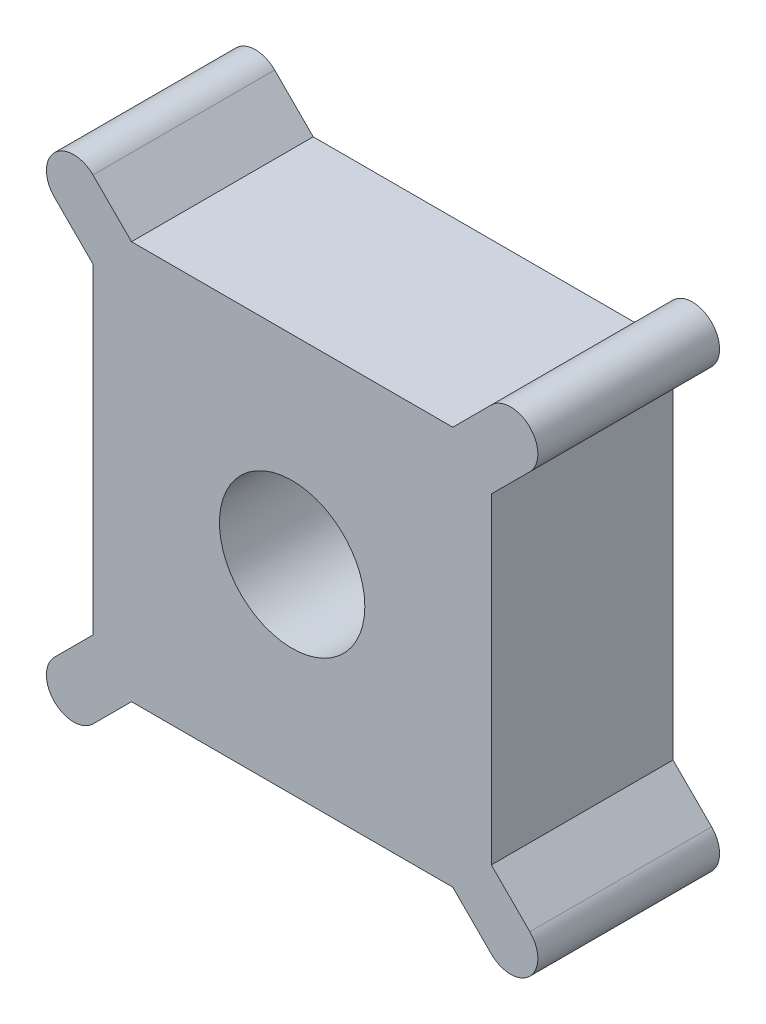
ISO-10303-21;
HEADER;
FILE_DESCRIPTION(('STEP AP214'),'2;1');
FILE_NAME('part.step','',(''),(''),'','','');
FILE_SCHEMA(('AUTOMOTIVE_DESIGN { 1 0 10303 214 1 1 1 1 }'));
ENDSEC;
DATA;
#1=APPLICATION_CONTEXT('core data for automotive mechanical design processes');
#2=APPLICATION_PROTOCOL_DEFINITION('international standard','automotive_design',2000,#1);
#3=PRODUCT_CONTEXT('',#1,'mechanical');
#4=PRODUCT('Part','Part','',(#3));
#5=PRODUCT_RELATED_PRODUCT_CATEGORY('part','',(#4));
#6=PRODUCT_DEFINITION_FORMATION('','',#4);
#7=PRODUCT_DEFINITION_CONTEXT('part definition',#1,'design');
#8=PRODUCT_DEFINITION('design','',#6,#7);
#9=PRODUCT_DEFINITION_SHAPE('','',#8);
#10=(LENGTH_UNIT() NAMED_UNIT(*) SI_UNIT(.MILLI.,.METRE.));
#11=(NAMED_UNIT(*) PLANE_ANGLE_UNIT() SI_UNIT($,.RADIAN.));
#12=(NAMED_UNIT(*) SI_UNIT($,.STERADIAN.) SOLID_ANGLE_UNIT());
#13=UNCERTAINTY_MEASURE_WITH_UNIT(LENGTH_MEASURE(1.E-05),#10,'distance_accuracy_value','');
#14=(GEOMETRIC_REPRESENTATION_CONTEXT(3) GLOBAL_UNCERTAINTY_ASSIGNED_CONTEXT((#13)) GLOBAL_UNIT_ASSIGNED_CONTEXT((#10,
#11,#12)) REPRESENTATION_CONTEXT('',''));
#15=CARTESIAN_POINT('',(0.,0.,0.));
#16=DIRECTION('',(0.,0.,1.));
#17=DIRECTION('',(1.,0.,0.));
#18=AXIS2_PLACEMENT_3D('',#15,#16,#17);
#19=CARTESIAN_POINT('',(-12.0208152801714,12.0208152801712,-10.));
#20=DIRECTION('',(0.,0.,1.));
#21=DIRECTION('',(1.,0.,0.));
#22=AXIS2_PLACEMENT_3D('',#19,#20,#21);
#23=CYLINDRICAL_SURFACE('',#22,1.5);
#24=CARTESIAN_POINT('',(-12.0208152801714,12.0208152801712,0.));
#25=DIRECTION('',(0.,0.,1.));
#26=DIRECTION('',(1.,0.,0.));
#27=AXIS2_PLACEMENT_3D('',#24,#25,#26);
#28=CIRCLE('',#27,1.5);
#29=CARTESIAN_POINT('',(-10.9601551083916,13.0814754519511,0.));
#30=VERTEX_POINT('',#29);
#31=CARTESIAN_POINT('',(-13.0814754519512,10.9601551083914,0.));
#32=VERTEX_POINT('',#31);
#33=EDGE_CURVE('E186',#30,#32,#28,.T.);
#34=ORIENTED_EDGE('',*,*,#33,.F.);
#35=DIRECTION('',(0.,0.,1.));
#36=VECTOR('',#35,1.);
#37=CARTESIAN_POINT('',(-10.9601551083916,13.0814754519511,-10.));
#38=LINE('',#37,#36);
#39=CARTESIAN_POINT('',(-10.9601551083916,13.0814754519511,-10.));
#40=VERTEX_POINT('',#39);
#41=EDGE_CURVE('E11',#40,#30,#38,.T.);
#42=ORIENTED_EDGE('',*,*,#41,.F.);
#43=CARTESIAN_POINT('',(-12.0208152801714,12.0208152801712,-10.));
#44=DIRECTION('',(0.,0.,1.));
#45=DIRECTION('',(1.,0.,0.));
#46=AXIS2_PLACEMENT_3D('',#43,#44,#45);
#47=CIRCLE('',#46,1.5);
#48=CARTESIAN_POINT('',(-13.0814754519512,10.9601551083914,-10.));
#49=VERTEX_POINT('',#48);
#50=EDGE_CURVE('E231',#40,#49,#47,.T.);
#51=ORIENTED_EDGE('',*,*,#50,.T.);
#52=DIRECTION('',(0.,0.,1.));
#53=VECTOR('',#52,1.);
#54=CARTESIAN_POINT('',(-13.0814754519512,10.9601551083914,-10.));
#55=LINE('',#54,#53);
#56=EDGE_CURVE('E44',#49,#32,#55,.T.);
#57=ORIENTED_EDGE('',*,*,#56,.T.);
#58=EDGE_LOOP('',(#34,#42,#51,#57));
#59=FACE_BOUND('',#58,.T.);
#60=ADVANCED_FACE('F41',(#59),#23,.T.);
#61=CARTESIAN_POINT('',(-10.9601551083916,13.0814754519511,-10.));
#62=DIRECTION('',(0.707106781186544,0.707106781186551,0.));
#63=DIRECTION('',(-0.707106781186551,0.707106781186544,0.));
#64=AXIS2_PLACEMENT_3D('',#61,#62,#63);
#65=PLANE('',#64);
#66=DIRECTION('',(-0.707106781186551,0.707106781186544,0.));
#67=VECTOR('',#66,1.);
#68=CARTESIAN_POINT('',(-10.9601551083916,13.0814754519511,0.));
#69=LINE('',#68,#67);
#70=CARTESIAN_POINT('',(-8.83883476483191,10.9601551083914,0.));
#71=VERTEX_POINT('',#70);
#72=EDGE_CURVE('E229',#71,#30,#69,.T.);
#73=ORIENTED_EDGE('',*,*,#72,.F.);
#74=DIRECTION('',(0.,0.,1.));
#75=VECTOR('',#74,1.);
#76=CARTESIAN_POINT('',(-8.83883476483191,10.9601551083914,-10.));
#77=LINE('',#76,#75);
#78=CARTESIAN_POINT('',(-8.83883476483191,10.9601551083914,-10.));
#79=VERTEX_POINT('',#78);
#80=EDGE_CURVE('E50',#79,#71,#77,.T.);
#81=ORIENTED_EDGE('',*,*,#80,.F.);
#82=DIRECTION('',(-0.707106781186551,0.707106781186544,0.));
#83=VECTOR('',#82,1.);
#84=CARTESIAN_POINT('',(-10.9601551083916,13.0814754519511,-10.));
#85=LINE('',#84,#83);
#86=EDGE_CURVE('E176',#79,#40,#85,.T.);
#87=ORIENTED_EDGE('',*,*,#86,.T.);
#88=ORIENTED_EDGE('',*,*,#41,.T.);
#89=EDGE_LOOP('',(#73,#81,#87,#88));
#90=FACE_BOUND('',#89,.T.);
#91=ADVANCED_FACE('F259',(#90),#65,.T.);
#92=CARTESIAN_POINT('',(-8.83883476483191,10.9601551083914,-10.));
#93=DIRECTION('',(0.,1.,0.));
#94=DIRECTION('',(-1.,0.,0.));
#95=AXIS2_PLACEMENT_3D('',#92,#93,#94);
#96=PLANE('',#95);
#97=DIRECTION('',(-1.,0.,0.));
#98=VECTOR('',#97,1.);
#99=CARTESIAN_POINT('',(-8.83883476483191,10.9601551083914,0.));
#100=LINE('',#99,#98);
#101=CARTESIAN_POINT('',(8.83883476483182,10.9601551083915,0.));
#102=VERTEX_POINT('',#101);
#103=EDGE_CURVE('E163',#102,#71,#100,.T.);
#104=ORIENTED_EDGE('',*,*,#103,.F.);
#105=DIRECTION('',(0.,0.,1.));
#106=VECTOR('',#105,1.);
#107=CARTESIAN_POINT('',(8.83883476483182,10.9601551083915,-10.));
#108=LINE('',#107,#106);
#109=CARTESIAN_POINT('',(8.83883476483182,10.9601551083915,-10.));
#110=VERTEX_POINT('',#109);
#111=EDGE_CURVE('E158',#110,#102,#108,.T.);
#112=ORIENTED_EDGE('',*,*,#111,.F.);
#113=DIRECTION('',(-1.,0.,0.));
#114=VECTOR('',#113,1.);
#115=CARTESIAN_POINT('',(-8.83883476483191,10.9601551083914,-10.));
#116=LINE('',#115,#114);
#117=EDGE_CURVE('E161',#110,#79,#116,.T.);
#118=ORIENTED_EDGE('',*,*,#117,.T.);
#119=ORIENTED_EDGE('',*,*,#80,.T.);
#120=EDGE_LOOP('',(#104,#112,#118,#119));
#121=FACE_BOUND('',#120,.T.);
#122=ADVANCED_FACE('F160',(#121),#96,.T.);
#123=CARTESIAN_POINT('',(10.9601551083915,13.0814754519512,-10.));
#124=DIRECTION('',(-0.707106781186549,0.707106781186546,0.));
#125=DIRECTION('',(-0.707106781186546,-0.707106781186549,0.));
#126=AXIS2_PLACEMENT_3D('',#123,#124,#125);
#127=PLANE('',#126);
#128=DIRECTION('',(-0.707106781186546,-0.707106781186549,0.));
#129=VECTOR('',#128,1.);
#130=CARTESIAN_POINT('',(10.9601551083915,13.0814754519512,0.));
#131=LINE('',#130,#129);
#132=CARTESIAN_POINT('',(10.9601551083915,13.0814754519512,0.));
#133=VERTEX_POINT('',#132);
#134=EDGE_CURVE('E226',#133,#102,#131,.T.);
#135=ORIENTED_EDGE('',*,*,#134,.F.);
#136=DIRECTION('',(0.,0.,1.));
#137=VECTOR('',#136,1.);
#138=CARTESIAN_POINT('',(10.9601551083915,13.0814754519512,-10.));
#139=LINE('',#138,#137);
#140=CARTESIAN_POINT('',(10.9601551083915,13.0814754519512,-10.));
#141=VERTEX_POINT('',#140);
#142=EDGE_CURVE('E168',#141,#133,#139,.T.);
#143=ORIENTED_EDGE('',*,*,#142,.F.);
#144=DIRECTION('',(-0.707106781186546,-0.707106781186549,0.));
#145=VECTOR('',#144,1.);
#146=CARTESIAN_POINT('',(10.9601551083915,13.0814754519512,-10.));
#147=LINE('',#146,#145);
#148=EDGE_CURVE('E174',#141,#110,#147,.T.);
#149=ORIENTED_EDGE('',*,*,#148,.T.);
#150=ORIENTED_EDGE('',*,*,#111,.T.);
#151=EDGE_LOOP('',(#135,#143,#149,#150));
#152=FACE_BOUND('',#151,.T.);
#153=ADVANCED_FACE('F178',(#152),#127,.T.);
#154=CARTESIAN_POINT('',(12.0208152801713,12.0208152801713,-10.));
#155=DIRECTION('',(0.,0.,1.));
#156=DIRECTION('',(1.,0.,0.));
#157=AXIS2_PLACEMENT_3D('',#154,#155,#156);
#158=CYLINDRICAL_SURFACE('',#157,1.5);
#159=CARTESIAN_POINT('',(12.0208152801713,12.0208152801713,0.));
#160=DIRECTION('',(0.,0.,1.));
#161=DIRECTION('',(1.,0.,0.));
#162=AXIS2_PLACEMENT_3D('',#159,#160,#161);
#163=CIRCLE('',#162,1.5);
#164=CARTESIAN_POINT('',(13.0814754519511,10.9601551083915,0.));
#165=VERTEX_POINT('',#164);
#166=EDGE_CURVE('E223',#165,#133,#163,.T.);
#167=ORIENTED_EDGE('',*,*,#166,.F.);
#168=DIRECTION('',(0.,0.,1.));
#169=VECTOR('',#168,1.);
#170=CARTESIAN_POINT('',(13.0814754519511,10.9601551083915,-10.));
#171=LINE('',#170,#169);
#172=CARTESIAN_POINT('',(13.0814754519511,10.9601551083915,-10.));
#173=VERTEX_POINT('',#172);
#174=EDGE_CURVE('E235',#173,#165,#171,.T.);
#175=ORIENTED_EDGE('',*,*,#174,.F.);
#176=CARTESIAN_POINT('',(12.0208152801713,12.0208152801713,-10.));
#177=DIRECTION('',(0.,0.,1.));
#178=DIRECTION('',(1.,0.,0.));
#179=AXIS2_PLACEMENT_3D('',#176,#177,#178);
#180=CIRCLE('',#179,1.5);
#181=EDGE_CURVE('E179',#173,#141,#180,.T.);
#182=ORIENTED_EDGE('',*,*,#181,.T.);
#183=ORIENTED_EDGE('',*,*,#142,.T.);
#184=EDGE_LOOP('',(#167,#175,#182,#183));
#185=FACE_BOUND('',#184,.T.);
#186=ADVANCED_FACE('F272',(#185),#158,.T.);
#187=CARTESIAN_POINT('',(13.0814754519511,10.9601551083915,-10.));
#188=DIRECTION('',(0.707106781186549,-0.707106781186546,0.));
#189=DIRECTION('',(0.707106781186546,0.707106781186549,0.));
#190=AXIS2_PLACEMENT_3D('',#187,#188,#189);
#191=PLANE('',#190);
#192=DIRECTION('',(0.707106781186546,0.707106781186549,0.));
#193=VECTOR('',#192,1.);
#194=CARTESIAN_POINT('',(13.0814754519511,10.9601551083915,0.));
#195=LINE('',#194,#193);
#196=CARTESIAN_POINT('',(10.9601551083915,8.83883476483187,0.));
#197=VERTEX_POINT('',#196);
#198=EDGE_CURVE('E220',#197,#165,#195,.T.);
#199=ORIENTED_EDGE('',*,*,#198,.F.);
#200=DIRECTION('',(0.,0.,1.));
#201=VECTOR('',#200,1.);
#202=CARTESIAN_POINT('',(10.9601551083915,8.83883476483187,-10.));
#203=LINE('',#202,#201);
#204=CARTESIAN_POINT('',(10.9601551083915,8.83883476483187,-10.));
#205=VERTEX_POINT('',#204);
#206=EDGE_CURVE('E237',#205,#197,#203,.T.);
#207=ORIENTED_EDGE('',*,*,#206,.F.);
#208=DIRECTION('',(0.707106781186546,0.707106781186549,0.));
#209=VECTOR('',#208,1.);
#210=CARTESIAN_POINT('',(13.0814754519511,10.9601551083915,-10.));
#211=LINE('',#210,#209);
#212=EDGE_CURVE('E181',#205,#173,#211,.T.);
#213=ORIENTED_EDGE('',*,*,#212,.T.);
#214=ORIENTED_EDGE('',*,*,#174,.T.);
#215=EDGE_LOOP('',(#199,#207,#213,#214));
#216=FACE_BOUND('',#215,.T.);
#217=ADVANCED_FACE('F275',(#216),#191,.T.);
#218=CARTESIAN_POINT('',(10.9601551083915,-8.83883476483186,-10.));
#219=DIRECTION('',(1.,0.,0.));
#220=DIRECTION('',(0.,1.,0.));
#221=AXIS2_PLACEMENT_3D('',#218,#219,#220);
#222=PLANE('',#221);
#223=DIRECTION('',(0.,1.,0.));
#224=VECTOR('',#223,1.);
#225=CARTESIAN_POINT('',(10.9601551083915,-8.83883476483186,0.));
#226=LINE('',#225,#224);
#227=CARTESIAN_POINT('',(10.9601551083915,-8.83883476483186,0.));
#228=VERTEX_POINT('',#227);
#229=EDGE_CURVE('E217',#228,#197,#226,.T.);
#230=ORIENTED_EDGE('',*,*,#229,.F.);
#231=DIRECTION('',(0.,0.,1.));
#232=VECTOR('',#231,1.);
#233=CARTESIAN_POINT('',(10.9601551083915,-8.83883476483186,-10.));
#234=LINE('',#233,#232);
#235=CARTESIAN_POINT('',(10.9601551083915,-8.83883476483186,-10.));
#236=VERTEX_POINT('',#235);
#237=EDGE_CURVE('E239',#236,#228,#234,.T.);
#238=ORIENTED_EDGE('',*,*,#237,.F.);
#239=DIRECTION('',(0.,1.,0.));
#240=VECTOR('',#239,1.);
#241=CARTESIAN_POINT('',(10.9601551083915,-8.83883476483186,-10.));
#242=LINE('',#241,#240);
#243=EDGE_CURVE('E366',#236,#205,#242,.T.);
#244=ORIENTED_EDGE('',*,*,#243,.T.);
#245=ORIENTED_EDGE('',*,*,#206,.T.);
#246=EDGE_LOOP('',(#230,#238,#244,#245));
#247=FACE_BOUND('',#246,.T.);
#248=ADVANCED_FACE('F279',(#247),#222,.T.);
#249=CARTESIAN_POINT('',(13.0814754519511,-10.9601551083915,-10.));
#250=DIRECTION('',(0.707106781186549,0.707106781186546,0.));
#251=DIRECTION('',(-0.707106781186546,0.707106781186549,0.));
#252=AXIS2_PLACEMENT_3D('',#249,#250,#251);
#253=PLANE('',#252);
#254=DIRECTION('',(-0.707106781186546,0.707106781186549,0.));
#255=VECTOR('',#254,1.);
#256=CARTESIAN_POINT('',(13.0814754519511,-10.9601551083915,0.));
#257=LINE('',#256,#255);
#258=CARTESIAN_POINT('',(13.0814754519511,-10.9601551083915,0.));
#259=VERTEX_POINT('',#258);
#260=EDGE_CURVE('E214',#259,#228,#257,.T.);
#261=ORIENTED_EDGE('',*,*,#260,.F.);
#262=DIRECTION('',(0.,0.,1.));
#263=VECTOR('',#262,1.);
#264=CARTESIAN_POINT('',(13.0814754519511,-10.9601551083915,-10.));
#265=LINE('',#264,#263);
#266=CARTESIAN_POINT('',(13.0814754519511,-10.9601551083915,-10.));
#267=VERTEX_POINT('',#266);
#268=EDGE_CURVE('E241',#267,#259,#265,.T.);
#269=ORIENTED_EDGE('',*,*,#268,.F.);
#270=DIRECTION('',(-0.707106781186546,0.707106781186549,0.));
#271=VECTOR('',#270,1.);
#272=CARTESIAN_POINT('',(13.0814754519511,-10.9601551083915,-10.));
#273=LINE('',#272,#271);
#274=EDGE_CURVE('E363',#267,#236,#273,.T.);
#275=ORIENTED_EDGE('',*,*,#274,.T.);
#276=ORIENTED_EDGE('',*,*,#237,.T.);
#277=EDGE_LOOP('',(#261,#269,#275,#276));
#278=FACE_BOUND('',#277,.T.);
#279=ADVANCED_FACE('F283',(#278),#253,.T.);
#280=CARTESIAN_POINT('',(12.0208152801713,-12.0208152801713,-10.));
#281=DIRECTION('',(0.,0.,1.));
#282=DIRECTION('',(1.,0.,0.));
#283=AXIS2_PLACEMENT_3D('',#280,#281,#282);
#284=CYLINDRICAL_SURFACE('',#283,1.5);
#285=CARTESIAN_POINT('',(12.0208152801713,-12.0208152801713,0.));
#286=DIRECTION('',(0.,0.,1.));
#287=DIRECTION('',(1.,0.,0.));
#288=AXIS2_PLACEMENT_3D('',#285,#286,#287);
#289=CIRCLE('',#288,1.5);
#290=CARTESIAN_POINT('',(10.9601551083915,-13.0814754519511,0.));
#291=VERTEX_POINT('',#290);
#292=EDGE_CURVE('E211',#291,#259,#289,.T.);
#293=ORIENTED_EDGE('',*,*,#292,.F.);
#294=DIRECTION('',(0.,0.,1.));
#295=VECTOR('',#294,1.);
#296=CARTESIAN_POINT('',(10.9601551083915,-13.0814754519511,-10.));
#297=LINE('',#296,#295);
#298=CARTESIAN_POINT('',(10.9601551083915,-13.0814754519511,-10.));
#299=VERTEX_POINT('',#298);
#300=EDGE_CURVE('E243',#299,#291,#297,.T.);
#301=ORIENTED_EDGE('',*,*,#300,.F.);
#302=CARTESIAN_POINT('',(12.0208152801713,-12.0208152801713,-10.));
#303=DIRECTION('',(0.,0.,1.));
#304=DIRECTION('',(1.,0.,0.));
#305=AXIS2_PLACEMENT_3D('',#302,#303,#304);
#306=CIRCLE('',#305,1.5);
#307=EDGE_CURVE('E360',#299,#267,#306,.T.);
#308=ORIENTED_EDGE('',*,*,#307,.T.);
#309=ORIENTED_EDGE('',*,*,#268,.T.);
#310=EDGE_LOOP('',(#293,#301,#308,#309));
#311=FACE_BOUND('',#310,.T.);
#312=ADVANCED_FACE('F287',(#311),#284,.T.);
#313=CARTESIAN_POINT('',(10.9601551083915,-13.0814754519511,-10.));
#314=DIRECTION('',(-0.707106781186548,-0.707106781186547,0.));
#315=DIRECTION('',(0.707106781186547,-0.707106781186548,0.));
#316=AXIS2_PLACEMENT_3D('',#313,#314,#315);
#317=PLANE('',#316);
#318=DIRECTION('',(0.707106781186547,-0.707106781186548,0.));
#319=VECTOR('',#318,1.);
#320=CARTESIAN_POINT('',(10.9601551083915,-13.0814754519511,0.));
#321=LINE('',#320,#319);
#322=CARTESIAN_POINT('',(8.83883476483183,-10.9601551083915,0.));
#323=VERTEX_POINT('',#322);
#324=EDGE_CURVE('E208',#323,#291,#321,.T.);
#325=ORIENTED_EDGE('',*,*,#324,.F.);
#326=DIRECTION('',(0.,0.,1.));
#327=VECTOR('',#326,1.);
#328=CARTESIAN_POINT('',(8.83883476483183,-10.9601551083915,-10.));
#329=LINE('',#328,#327);
#330=CARTESIAN_POINT('',(8.83883476483183,-10.9601551083915,-10.));
#331=VERTEX_POINT('',#330);
#332=EDGE_CURVE('E245',#331,#323,#329,.T.);
#333=ORIENTED_EDGE('',*,*,#332,.F.);
#334=DIRECTION('',(0.707106781186547,-0.707106781186548,0.));
#335=VECTOR('',#334,1.);
#336=CARTESIAN_POINT('',(10.9601551083915,-13.0814754519511,-10.));
#337=LINE('',#336,#335);
#338=EDGE_CURVE('E357',#331,#299,#337,.T.);
#339=ORIENTED_EDGE('',*,*,#338,.T.);
#340=ORIENTED_EDGE('',*,*,#300,.T.);
#341=EDGE_LOOP('',(#325,#333,#339,#340));
#342=FACE_BOUND('',#341,.T.);
#343=ADVANCED_FACE('F291',(#342),#317,.T.);
#344=CARTESIAN_POINT('',(-8.8388347648319,-10.9601551083914,-10.));
#345=DIRECTION('',(0.,-1.,0.));
#346=DIRECTION('',(1.,0.,0.));
#347=AXIS2_PLACEMENT_3D('',#344,#345,#346);
#348=PLANE('',#347);
#349=DIRECTION('',(1.,0.,0.));
#350=VECTOR('',#349,1.);
#351=CARTESIAN_POINT('',(-8.8388347648319,-10.9601551083914,0.));
#352=LINE('',#351,#350);
#353=CARTESIAN_POINT('',(-8.8388347648319,-10.9601551083914,0.));
#354=VERTEX_POINT('',#353);
#355=EDGE_CURVE('E205',#354,#323,#352,.T.);
#356=ORIENTED_EDGE('',*,*,#355,.F.);
#357=DIRECTION('',(0.,0.,1.));
#358=VECTOR('',#357,1.);
#359=CARTESIAN_POINT('',(-8.8388347648319,-10.9601551083914,-10.));
#360=LINE('',#359,#358);
#361=CARTESIAN_POINT('',(-8.8388347648319,-10.9601551083914,-10.));
#362=VERTEX_POINT('',#361);
#363=EDGE_CURVE('E247',#362,#354,#360,.T.);
#364=ORIENTED_EDGE('',*,*,#363,.F.);
#365=DIRECTION('',(1.,0.,0.));
#366=VECTOR('',#365,1.);
#367=CARTESIAN_POINT('',(-8.8388347648319,-10.9601551083914,-10.));
#368=LINE('',#367,#366);
#369=EDGE_CURVE('E354',#362,#331,#368,.T.);
#370=ORIENTED_EDGE('',*,*,#369,.T.);
#371=ORIENTED_EDGE('',*,*,#332,.T.);
#372=EDGE_LOOP('',(#356,#364,#370,#371));
#373=FACE_BOUND('',#372,.T.);
#374=ADVANCED_FACE('F295',(#373),#348,.T.);
#375=CARTESIAN_POINT('',(-10.9601551083916,-13.0814754519511,-10.));
#376=DIRECTION('',(0.707106781186544,-0.707106781186551,0.));
#377=DIRECTION('',(0.707106781186551,0.707106781186544,0.));
#378=AXIS2_PLACEMENT_3D('',#375,#376,#377);
#379=PLANE('',#378);
#380=DIRECTION('',(0.707106781186551,0.707106781186544,0.));
#381=VECTOR('',#380,1.);
#382=CARTESIAN_POINT('',(-10.9601551083916,-13.0814754519511,0.));
#383=LINE('',#382,#381);
#384=CARTESIAN_POINT('',(-10.9601551083916,-13.0814754519511,0.));
#385=VERTEX_POINT('',#384);
#386=EDGE_CURVE('E202',#385,#354,#383,.T.);
#387=ORIENTED_EDGE('',*,*,#386,.F.);
#388=DIRECTION('',(0.,0.,1.));
#389=VECTOR('',#388,1.);
#390=CARTESIAN_POINT('',(-10.9601551083916,-13.0814754519511,-10.));
#391=LINE('',#390,#389);
#392=CARTESIAN_POINT('',(-10.9601551083916,-13.0814754519511,-10.));
#393=VERTEX_POINT('',#392);
#394=EDGE_CURVE('E249',#393,#385,#391,.T.);
#395=ORIENTED_EDGE('',*,*,#394,.F.);
#396=DIRECTION('',(0.707106781186551,0.707106781186544,0.));
#397=VECTOR('',#396,1.);
#398=CARTESIAN_POINT('',(-10.9601551083916,-13.0814754519511,-10.));
#399=LINE('',#398,#397);
#400=EDGE_CURVE('E351',#393,#362,#399,.T.);
#401=ORIENTED_EDGE('',*,*,#400,.T.);
#402=ORIENTED_EDGE('',*,*,#363,.T.);
#403=EDGE_LOOP('',(#387,#395,#401,#402));
#404=FACE_BOUND('',#403,.T.);
#405=ADVANCED_FACE('F299',(#404),#379,.T.);
#406=CARTESIAN_POINT('',(-12.0208152801714,-12.0208152801712,-10.));
#407=DIRECTION('',(0.,0.,1.));
#408=DIRECTION('',(1.,0.,0.));
#409=AXIS2_PLACEMENT_3D('',#406,#407,#408);
#410=CYLINDRICAL_SURFACE('',#409,1.5);
#411=CARTESIAN_POINT('',(-12.0208152801714,-12.0208152801712,0.));
#412=DIRECTION('',(0.,0.,1.));
#413=DIRECTION('',(1.,0.,0.));
#414=AXIS2_PLACEMENT_3D('',#411,#412,#413);
#415=CIRCLE('',#414,1.5);
#416=CARTESIAN_POINT('',(-13.0814754519512,-10.9601551083914,0.));
#417=VERTEX_POINT('',#416);
#418=EDGE_CURVE('E199',#417,#385,#415,.T.);
#419=ORIENTED_EDGE('',*,*,#418,.F.);
#420=DIRECTION('',(0.,0.,1.));
#421=VECTOR('',#420,1.);
#422=CARTESIAN_POINT('',(-13.0814754519512,-10.9601551083914,-10.));
#423=LINE('',#422,#421);
#424=CARTESIAN_POINT('',(-13.0814754519512,-10.9601551083914,-10.));
#425=VERTEX_POINT('',#424);
#426=EDGE_CURVE('E251',#425,#417,#423,.T.);
#427=ORIENTED_EDGE('',*,*,#426,.F.);
#428=CARTESIAN_POINT('',(-12.0208152801714,-12.0208152801712,-10.));
#429=DIRECTION('',(0.,0.,1.));
#430=DIRECTION('',(1.,0.,0.));
#431=AXIS2_PLACEMENT_3D('',#428,#429,#430);
#432=CIRCLE('',#431,1.5);
#433=EDGE_CURVE('E348',#425,#393,#432,.T.);
#434=ORIENTED_EDGE('',*,*,#433,.T.);
#435=ORIENTED_EDGE('',*,*,#394,.T.);
#436=EDGE_LOOP('',(#419,#427,#434,#435));
#437=FACE_BOUND('',#436,.T.);
#438=ADVANCED_FACE('F303',(#437),#410,.T.);
#439=CARTESIAN_POINT('',(-13.0814754519512,-10.9601551083914,-10.));
#440=DIRECTION('',(-0.707106781186544,0.707106781186551,0.));
#441=DIRECTION('',(-0.707106781186551,-0.707106781186544,0.));
#442=AXIS2_PLACEMENT_3D('',#439,#440,#441);
#443=PLANE('',#442);
#444=DIRECTION('',(-0.707106781186551,-0.707106781186544,0.));
#445=VECTOR('',#444,1.);
#446=CARTESIAN_POINT('',(-13.0814754519512,-10.9601551083914,0.));
#447=LINE('',#446,#445);
#448=CARTESIAN_POINT('',(-10.9601551083915,-8.83883476483179,0.));
#449=VERTEX_POINT('',#448);
#450=EDGE_CURVE('E196',#449,#417,#447,.T.);
#451=ORIENTED_EDGE('',*,*,#450,.F.);
#452=DIRECTION('',(0.,0.,1.));
#453=VECTOR('',#452,1.);
#454=CARTESIAN_POINT('',(-10.9601551083915,-8.83883476483179,-10.));
#455=LINE('',#454,#453);
#456=CARTESIAN_POINT('',(-10.9601551083915,-8.83883476483179,-10.));
#457=VERTEX_POINT('',#456);
#458=EDGE_CURVE('E253',#457,#449,#455,.T.);
#459=ORIENTED_EDGE('',*,*,#458,.F.);
#460=DIRECTION('',(-0.707106781186551,-0.707106781186544,0.));
#461=VECTOR('',#460,1.);
#462=CARTESIAN_POINT('',(-13.0814754519512,-10.9601551083914,-10.));
#463=LINE('',#462,#461);
#464=EDGE_CURVE('E345',#457,#425,#463,.T.);
#465=ORIENTED_EDGE('',*,*,#464,.T.);
#466=ORIENTED_EDGE('',*,*,#426,.T.);
#467=EDGE_LOOP('',(#451,#459,#465,#466));
#468=FACE_BOUND('',#467,.T.);
#469=ADVANCED_FACE('F307',(#468),#443,.T.);
#470=CARTESIAN_POINT('',(-10.9601551083915,8.83883476483178,-10.));
#471=DIRECTION('',(-1.,0.,0.));
#472=DIRECTION('',(0.,-1.,0.));
#473=AXIS2_PLACEMENT_3D('',#470,#471,#472);
#474=PLANE('',#473);
#475=DIRECTION('',(0.,-1.,0.));
#476=VECTOR('',#475,1.);
#477=CARTESIAN_POINT('',(-10.9601551083915,8.83883476483178,0.));
#478=LINE('',#477,#476);
#479=CARTESIAN_POINT('',(-10.9601551083915,8.83883476483178,0.));
#480=VERTEX_POINT('',#479);
#481=EDGE_CURVE('E193',#480,#449,#478,.T.);
#482=ORIENTED_EDGE('',*,*,#481,.F.);
#483=DIRECTION('',(0.,0.,1.));
#484=VECTOR('',#483,1.);
#485=CARTESIAN_POINT('',(-10.9601551083915,8.83883476483178,-10.));
#486=LINE('',#485,#484);
#487=CARTESIAN_POINT('',(-10.9601551083915,8.83883476483178,-10.));
#488=VERTEX_POINT('',#487);
#489=EDGE_CURVE('E254',#488,#480,#486,.T.);
#490=ORIENTED_EDGE('',*,*,#489,.F.);
#491=DIRECTION('',(0.,-1.,0.));
#492=VECTOR('',#491,1.);
#493=CARTESIAN_POINT('',(-10.9601551083915,8.83883476483178,-10.));
#494=LINE('',#493,#492);
#495=EDGE_CURVE('E342',#488,#457,#494,.T.);
#496=ORIENTED_EDGE('',*,*,#495,.T.);
#497=ORIENTED_EDGE('',*,*,#458,.T.);
#498=EDGE_LOOP('',(#482,#490,#496,#497));
#499=FACE_BOUND('',#498,.T.);
#500=ADVANCED_FACE('F311',(#499),#474,.T.);
#501=CARTESIAN_POINT('',(-13.0814754519512,10.9601551083914,-10.));
#502=DIRECTION('',(-0.707106781186543,-0.707106781186552,0.));
#503=DIRECTION('',(0.707106781186552,-0.707106781186543,0.));
#504=AXIS2_PLACEMENT_3D('',#501,#502,#503);
#505=PLANE('',#504);
#506=DIRECTION('',(0.707106781186552,-0.707106781186543,0.));
#507=VECTOR('',#506,1.);
#508=CARTESIAN_POINT('',(-13.0814754519512,10.9601551083914,0.));
#509=LINE('',#508,#507);
#510=EDGE_CURVE('E189',#32,#480,#509,.T.);
#511=ORIENTED_EDGE('',*,*,#510,.F.);
#512=ORIENTED_EDGE('',*,*,#56,.F.);
#513=DIRECTION('',(0.707106781186552,-0.707106781186543,0.));
#514=VECTOR('',#513,1.);
#515=CARTESIAN_POINT('',(-13.0814754519512,10.9601551083914,-10.));
#516=LINE('',#515,#514);
#517=EDGE_CURVE('E340',#49,#488,#516,.T.);
#518=ORIENTED_EDGE('',*,*,#517,.T.);
#519=ORIENTED_EDGE('',*,*,#489,.T.);
#520=EDGE_LOOP('',(#511,#512,#518,#519));
#521=FACE_BOUND('',#520,.T.);
#522=ADVANCED_FACE('F256',(#521),#505,.T.);
#523=CARTESIAN_POINT('',(-12.0208152801714,12.0208152801712,-10.));
#524=DIRECTION('',(0.,0.,1.));
#525=DIRECTION('',(1.,0.,0.));
#526=AXIS2_PLACEMENT_3D('',#523,#524,#525);
#527=PLANE('',#526);
#528=CARTESIAN_POINT('',(0.,0.,-10.));
#529=DIRECTION('',(0.,0.,1.));
#530=DIRECTION('',(1.,0.,0.));
#531=AXIS2_PLACEMENT_3D('',#528,#529,#530);
#532=CIRCLE('',#531,4.);
#533=CARTESIAN_POINT('',(4.,0.,-10.));
#534=VERTEX_POINT('',#533);
#535=EDGE_CURVE('E190',#534,#534,#532,.T.);
#536=ORIENTED_EDGE('',*,*,#535,.T.);
#537=EDGE_LOOP('',(#536));
#538=FACE_BOUND('',#537,.T.);
#539=ORIENTED_EDGE('',*,*,#50,.F.);
#540=ORIENTED_EDGE('',*,*,#86,.F.);
#541=ORIENTED_EDGE('',*,*,#117,.F.);
#542=ORIENTED_EDGE('',*,*,#148,.F.);
#543=ORIENTED_EDGE('',*,*,#181,.F.);
#544=ORIENTED_EDGE('',*,*,#212,.F.);
#545=ORIENTED_EDGE('',*,*,#243,.F.);
#546=ORIENTED_EDGE('',*,*,#274,.F.);
#547=ORIENTED_EDGE('',*,*,#307,.F.);
#548=ORIENTED_EDGE('',*,*,#338,.F.);
#549=ORIENTED_EDGE('',*,*,#369,.F.);
#550=ORIENTED_EDGE('',*,*,#400,.F.);
#551=ORIENTED_EDGE('',*,*,#433,.F.);
#552=ORIENTED_EDGE('',*,*,#464,.F.);
#553=ORIENTED_EDGE('',*,*,#495,.F.);
#554=ORIENTED_EDGE('',*,*,#517,.F.);
#555=EDGE_LOOP('',(#539,#540,#541,#542,#543,#544,#545,#546,#547,#548,#549,#550,#551,#552,#553,#554));
#556=FACE_BOUND('',#555,.T.);
#557=ADVANCED_FACE('F172',(#538,#556),#527,.F.);
#558=CARTESIAN_POINT('',(-12.0208152801714,12.0208152801712,0.));
#559=DIRECTION('',(0.,0.,1.));
#560=DIRECTION('',(1.,0.,0.));
#561=AXIS2_PLACEMENT_3D('',#558,#559,#560);
#562=PLANE('',#561);
#563=CARTESIAN_POINT('',(0.,0.,0.));
#564=DIRECTION('',(0.,0.,1.));
#565=DIRECTION('',(1.,0.,0.));
#566=AXIS2_PLACEMENT_3D('',#563,#564,#565);
#567=CIRCLE('',#566,4.);
#568=CARTESIAN_POINT('',(4.,0.,0.));
#569=VERTEX_POINT('',#568);
#570=EDGE_CURVE('E335',#569,#569,#567,.T.);
#571=ORIENTED_EDGE('',*,*,#570,.F.);
#572=EDGE_LOOP('',(#571));
#573=FACE_BOUND('',#572,.T.);
#574=ORIENTED_EDGE('',*,*,#33,.T.);
#575=ORIENTED_EDGE('',*,*,#510,.T.);
#576=ORIENTED_EDGE('',*,*,#481,.T.);
#577=ORIENTED_EDGE('',*,*,#450,.T.);
#578=ORIENTED_EDGE('',*,*,#418,.T.);
#579=ORIENTED_EDGE('',*,*,#386,.T.);
#580=ORIENTED_EDGE('',*,*,#355,.T.);
#581=ORIENTED_EDGE('',*,*,#324,.T.);
#582=ORIENTED_EDGE('',*,*,#292,.T.);
#583=ORIENTED_EDGE('',*,*,#260,.T.);
#584=ORIENTED_EDGE('',*,*,#229,.T.);
#585=ORIENTED_EDGE('',*,*,#198,.T.);
#586=ORIENTED_EDGE('',*,*,#166,.T.);
#587=ORIENTED_EDGE('',*,*,#134,.T.);
#588=ORIENTED_EDGE('',*,*,#103,.T.);
#589=ORIENTED_EDGE('',*,*,#72,.T.);
#590=EDGE_LOOP('',(#574,#575,#576,#577,#578,#579,#580,#581,#582,#583,#584,#585,#586,#587,#588,#589));
#591=FACE_BOUND('',#590,.T.);
#592=ADVANCED_FACE('F258',(#573,#591),#562,.T.);
#593=CARTESIAN_POINT('',(0.,0.,-10.));
#594=DIRECTION('',(0.,0.,1.));
#595=DIRECTION('',(1.,0.,0.));
#596=AXIS2_PLACEMENT_3D('',#593,#594,#595);
#597=CYLINDRICAL_SURFACE('',#596,4.);
#598=ORIENTED_EDGE('',*,*,#535,.F.);
#599=EDGE_LOOP('',(#598));
#600=FACE_BOUND('',#599,.T.);
#601=ORIENTED_EDGE('',*,*,#570,.T.);
#602=EDGE_LOOP('',(#601));
#603=FACE_BOUND('',#602,.T.);
#604=ADVANCED_FACE('F323',(#600,#603),#597,.F.);
#605=CLOSED_SHELL('',(#60,#91,#122,#153,#186,#217,#248,#279,#312,#343,#374,#405,#438,#469,#500,
#522,#557,#592,#604));
#606=MANIFOLD_SOLID_BREP('B2',#605);
#607=ADVANCED_BREP_SHAPE_REPRESENTATION('',(#18,#606),#14);
#608=SHAPE_DEFINITION_REPRESENTATION(#9,#607);
ENDSEC;
END-ISO-10303-21;
